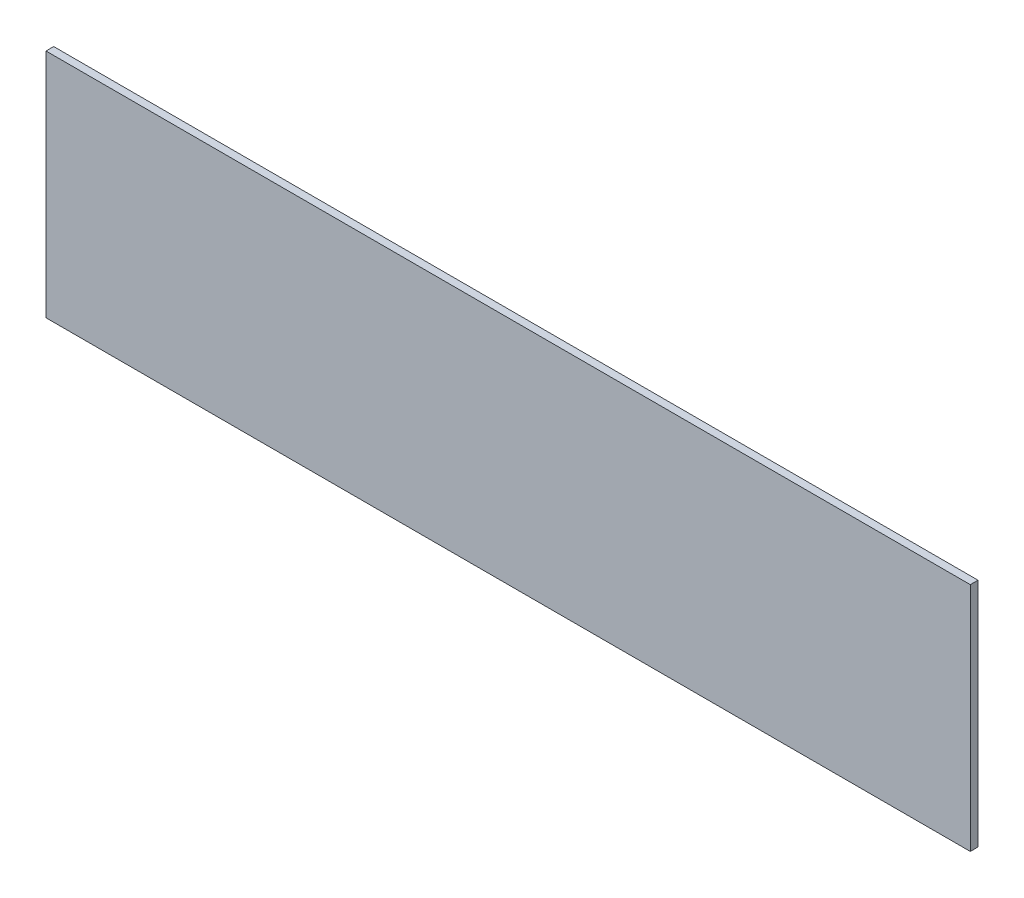
ISO-10303-21;
HEADER;
FILE_DESCRIPTION(('STEP AP214'),'2;1');
FILE_NAME('part.step','',(''),(''),'','','');
FILE_SCHEMA(('AUTOMOTIVE_DESIGN { 1 0 10303 214 1 1 1 1 }'));
ENDSEC;
DATA;
#1=APPLICATION_CONTEXT('core data for automotive mechanical design processes');
#2=APPLICATION_PROTOCOL_DEFINITION('international standard','automotive_design',2000,#1);
#3=PRODUCT_CONTEXT('',#1,'mechanical');
#4=PRODUCT('Part','Part','',(#3));
#5=PRODUCT_RELATED_PRODUCT_CATEGORY('part','',(#4));
#6=PRODUCT_DEFINITION_FORMATION('','',#4);
#7=PRODUCT_DEFINITION_CONTEXT('part definition',#1,'design');
#8=PRODUCT_DEFINITION('design','',#6,#7);
#9=PRODUCT_DEFINITION_SHAPE('','',#8);
#10=(LENGTH_UNIT() NAMED_UNIT(*) SI_UNIT(.MILLI.,.METRE.));
#11=(NAMED_UNIT(*) PLANE_ANGLE_UNIT() SI_UNIT($,.RADIAN.));
#12=(NAMED_UNIT(*) SI_UNIT($,.STERADIAN.) SOLID_ANGLE_UNIT());
#13=UNCERTAINTY_MEASURE_WITH_UNIT(LENGTH_MEASURE(1.E-05),#10,'distance_accuracy_value','');
#14=(GEOMETRIC_REPRESENTATION_CONTEXT(3) GLOBAL_UNCERTAINTY_ASSIGNED_CONTEXT((#13)) GLOBAL_UNIT_ASSIGNED_CONTEXT((#10,
#11,#12)) REPRESENTATION_CONTEXT('',''));
#15=CARTESIAN_POINT('',(0.,0.,0.));
#16=DIRECTION('',(0.,0.,1.));
#17=DIRECTION('',(1.,0.,0.));
#18=AXIS2_PLACEMENT_3D('',#15,#16,#17);
#19=CARTESIAN_POINT('',(152.4,38.1,2.54));
#20=DIRECTION('',(-1.,0.,0.));
#21=DIRECTION('',(0.,0.,1.));
#22=AXIS2_PLACEMENT_3D('',#19,#20,#21);
#23=PLANE('',#22);
#24=DIRECTION('',(0.,1.,0.));
#25=VECTOR('',#24,1.);
#26=CARTESIAN_POINT('',(152.4,38.1,0.));
#27=LINE('',#26,#25);
#28=CARTESIAN_POINT('',(152.4,-38.1,0.));
#29=VERTEX_POINT('',#28);
#30=CARTESIAN_POINT('',(152.4,38.1,0.));
#31=VERTEX_POINT('',#30);
#32=EDGE_CURVE('E96',#29,#31,#27,.T.);
#33=ORIENTED_EDGE('',*,*,#32,.T.);
#34=DIRECTION('',(0.,0.,-1.));
#35=VECTOR('',#34,1.);
#36=CARTESIAN_POINT('',(152.4,38.1,2.54));
#37=LINE('',#36,#35);
#38=CARTESIAN_POINT('',(152.4,38.1,2.54));
#39=VERTEX_POINT('',#38);
#40=EDGE_CURVE('E11',#39,#31,#37,.T.);
#41=ORIENTED_EDGE('',*,*,#40,.F.);
#42=DIRECTION('',(0.,1.,0.));
#43=VECTOR('',#42,1.);
#44=CARTESIAN_POINT('',(152.4,38.1,2.54));
#45=LINE('',#44,#43);
#46=CARTESIAN_POINT('',(152.4,-38.1,2.54));
#47=VERTEX_POINT('',#46);
#48=EDGE_CURVE('E84',#47,#39,#45,.T.);
#49=ORIENTED_EDGE('',*,*,#48,.F.);
#50=DIRECTION('',(0.,0.,-1.));
#51=VECTOR('',#50,1.);
#52=CARTESIAN_POINT('',(152.4,-38.1,2.54));
#53=LINE('',#52,#51);
#54=EDGE_CURVE('E92',#47,#29,#53,.T.);
#55=ORIENTED_EDGE('',*,*,#54,.T.);
#56=EDGE_LOOP('',(#33,#41,#49,#55));
#57=FACE_BOUND('',#56,.T.);
#58=ADVANCED_FACE('F33',(#57),#23,.F.);
#59=CARTESIAN_POINT('',(-152.4,38.1,2.54));
#60=DIRECTION('',(0.,-1.,0.));
#61=DIRECTION('',(0.,0.,-1.));
#62=AXIS2_PLACEMENT_3D('',#59,#60,#61);
#63=PLANE('',#62);
#64=DIRECTION('',(-1.,0.,0.));
#65=VECTOR('',#64,1.);
#66=CARTESIAN_POINT('',(-152.4,38.1,0.));
#67=LINE('',#66,#65);
#68=CARTESIAN_POINT('',(-152.4,38.1,0.));
#69=VERTEX_POINT('',#68);
#70=EDGE_CURVE('E88',#31,#69,#67,.T.);
#71=ORIENTED_EDGE('',*,*,#70,.T.);
#72=DIRECTION('',(0.,0.,-1.));
#73=VECTOR('',#72,1.);
#74=CARTESIAN_POINT('',(-152.4,38.1,2.54));
#75=LINE('',#74,#73);
#76=CARTESIAN_POINT('',(-152.4,38.1,2.54));
#77=VERTEX_POINT('',#76);
#78=EDGE_CURVE('E41',#77,#69,#75,.T.);
#79=ORIENTED_EDGE('',*,*,#78,.F.);
#80=DIRECTION('',(-1.,0.,0.));
#81=VECTOR('',#80,1.);
#82=CARTESIAN_POINT('',(-152.4,38.1,2.54));
#83=LINE('',#82,#81);
#84=EDGE_CURVE('E79',#39,#77,#83,.T.);
#85=ORIENTED_EDGE('',*,*,#84,.F.);
#86=ORIENTED_EDGE('',*,*,#40,.T.);
#87=EDGE_LOOP('',(#71,#79,#85,#86));
#88=FACE_BOUND('',#87,.T.);
#89=ADVANCED_FACE('F87',(#88),#63,.F.);
#90=CARTESIAN_POINT('',(-152.4,38.1,2.54));
#91=DIRECTION('',(1.,0.,0.));
#92=DIRECTION('',(0.,0.,-1.));
#93=AXIS2_PLACEMENT_3D('',#90,#91,#92);
#94=PLANE('',#93);
#95=DIRECTION('',(0.,-1.,0.));
#96=VECTOR('',#95,1.);
#97=CARTESIAN_POINT('',(-152.4,38.1,0.));
#98=LINE('',#97,#96);
#99=CARTESIAN_POINT('',(-152.4,-38.1,0.));
#100=VERTEX_POINT('',#99);
#101=EDGE_CURVE('E66',#69,#100,#98,.T.);
#102=ORIENTED_EDGE('',*,*,#101,.T.);
#103=DIRECTION('',(0.,0.,-1.));
#104=VECTOR('',#103,1.);
#105=CARTESIAN_POINT('',(-152.4,-38.1,2.54));
#106=LINE('',#105,#104);
#107=CARTESIAN_POINT('',(-152.4,-38.1,2.54));
#108=VERTEX_POINT('',#107);
#109=EDGE_CURVE('E89',#108,#100,#106,.T.);
#110=ORIENTED_EDGE('',*,*,#109,.F.);
#111=DIRECTION('',(0.,-1.,0.));
#112=VECTOR('',#111,1.);
#113=CARTESIAN_POINT('',(-152.4,38.1,2.54));
#114=LINE('',#113,#112);
#115=EDGE_CURVE('E82',#77,#108,#114,.T.);
#116=ORIENTED_EDGE('',*,*,#115,.F.);
#117=ORIENTED_EDGE('',*,*,#78,.T.);
#118=EDGE_LOOP('',(#102,#110,#116,#117));
#119=FACE_BOUND('',#118,.T.);
#120=ADVANCED_FACE('F90',(#119),#94,.F.);
#121=CARTESIAN_POINT('',(-152.4,-38.1,2.54));
#122=DIRECTION('',(0.,1.,0.));
#123=DIRECTION('',(0.,0.,1.));
#124=AXIS2_PLACEMENT_3D('',#121,#122,#123);
#125=PLANE('',#124);
#126=DIRECTION('',(1.,0.,0.));
#127=VECTOR('',#126,1.);
#128=CARTESIAN_POINT('',(-152.4,-38.1,0.));
#129=LINE('',#128,#127);
#130=EDGE_CURVE('E72',#100,#29,#129,.T.);
#131=ORIENTED_EDGE('',*,*,#130,.T.);
#132=ORIENTED_EDGE('',*,*,#54,.F.);
#133=DIRECTION('',(1.,0.,0.));
#134=VECTOR('',#133,1.);
#135=CARTESIAN_POINT('',(-152.4,-38.1,2.54));
#136=LINE('',#135,#134);
#137=EDGE_CURVE('E49',#108,#47,#136,.T.);
#138=ORIENTED_EDGE('',*,*,#137,.F.);
#139=ORIENTED_EDGE('',*,*,#109,.T.);
#140=EDGE_LOOP('',(#131,#132,#138,#139));
#141=FACE_BOUND('',#140,.T.);
#142=ADVANCED_FACE('F103',(#141),#125,.F.);
#143=CARTESIAN_POINT('',(0.,0.,2.54));
#144=DIRECTION('',(0.,0.,1.));
#145=DIRECTION('',(1.,0.,0.));
#146=AXIS2_PLACEMENT_3D('',#143,#144,#145);
#147=PLANE('',#146);
#148=ORIENTED_EDGE('',*,*,#48,.T.);
#149=ORIENTED_EDGE('',*,*,#84,.T.);
#150=ORIENTED_EDGE('',*,*,#115,.T.);
#151=ORIENTED_EDGE('',*,*,#137,.T.);
#152=EDGE_LOOP('',(#148,#149,#150,#151));
#153=FACE_BOUND('',#152,.T.);
#154=ADVANCED_FACE('F80',(#153),#147,.T.);
#155=CARTESIAN_POINT('',(0.,0.,0.));
#156=DIRECTION('',(0.,0.,1.));
#157=DIRECTION('',(1.,0.,0.));
#158=AXIS2_PLACEMENT_3D('',#155,#156,#157);
#159=PLANE('',#158);
#160=ORIENTED_EDGE('',*,*,#32,.F.);
#161=ORIENTED_EDGE('',*,*,#130,.F.);
#162=ORIENTED_EDGE('',*,*,#101,.F.);
#163=ORIENTED_EDGE('',*,*,#70,.F.);
#164=EDGE_LOOP('',(#160,#161,#162,#163));
#165=FACE_BOUND('',#164,.T.);
#166=ADVANCED_FACE('F106',(#165),#159,.F.);
#167=CLOSED_SHELL('',(#58,#89,#120,#142,#154,#166));
#168=MANIFOLD_SOLID_BREP('B2',#167);
#169=ADVANCED_BREP_SHAPE_REPRESENTATION('',(#18,#168),#14);
#170=SHAPE_DEFINITION_REPRESENTATION(#9,#169);
ENDSEC;
END-ISO-10303-21;
